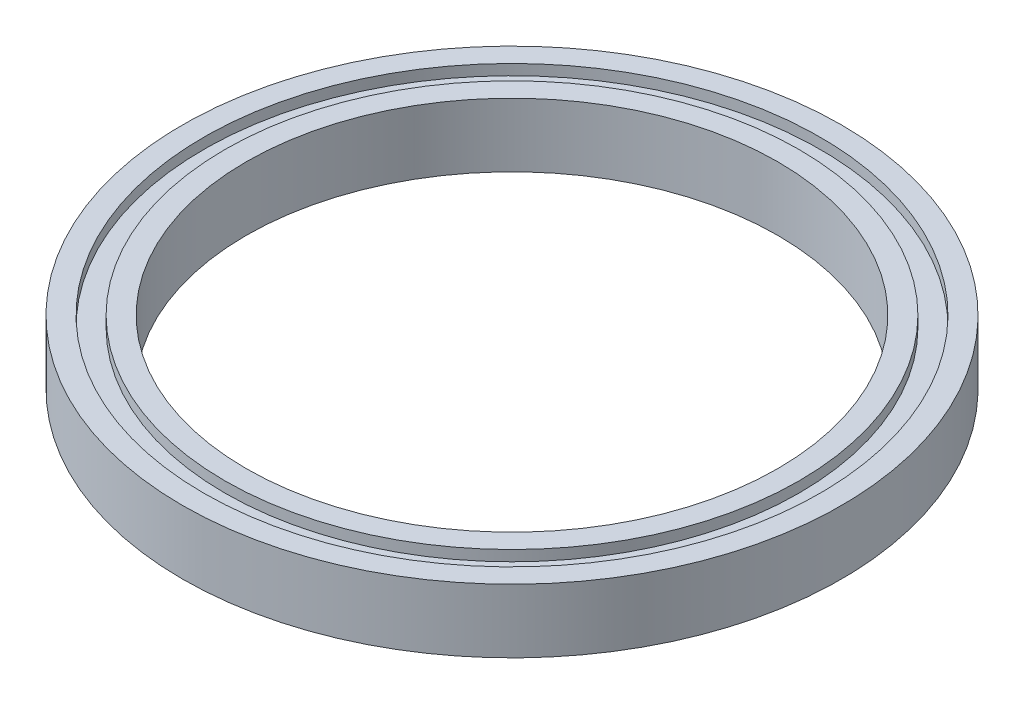
ISO-10303-21;
HEADER;
FILE_DESCRIPTION(('STEP AP214'),'2;1');
FILE_NAME('part.step','',(''),(''),'','','');
FILE_SCHEMA(('AUTOMOTIVE_DESIGN { 1 0 10303 214 1 1 1 1 }'));
ENDSEC;
DATA;
#1=APPLICATION_CONTEXT('core data for automotive mechanical design processes');
#2=APPLICATION_PROTOCOL_DEFINITION('international standard','automotive_design',2000,#1);
#3=PRODUCT_CONTEXT('',#1,'mechanical');
#4=PRODUCT('Part','Part','',(#3));
#5=PRODUCT_RELATED_PRODUCT_CATEGORY('part','',(#4));
#6=PRODUCT_DEFINITION_FORMATION('','',#4);
#7=PRODUCT_DEFINITION_CONTEXT('part definition',#1,'design');
#8=PRODUCT_DEFINITION('design','',#6,#7);
#9=PRODUCT_DEFINITION_SHAPE('','',#8);
#10=(LENGTH_UNIT() NAMED_UNIT(*) SI_UNIT(.MILLI.,.METRE.));
#11=(NAMED_UNIT(*) PLANE_ANGLE_UNIT() SI_UNIT($,.RADIAN.));
#12=(NAMED_UNIT(*) SI_UNIT($,.STERADIAN.) SOLID_ANGLE_UNIT());
#13=UNCERTAINTY_MEASURE_WITH_UNIT(LENGTH_MEASURE(1.E-05),#10,'distance_accuracy_value','');
#14=(GEOMETRIC_REPRESENTATION_CONTEXT(3) GLOBAL_UNCERTAINTY_ASSIGNED_CONTEXT((#13)) GLOBAL_UNIT_ASSIGNED_CONTEXT((#10,
#11,#12)) REPRESENTATION_CONTEXT('',''));
#15=CARTESIAN_POINT('',(0.,0.,0.));
#16=DIRECTION('',(0.,0.,1.));
#17=DIRECTION('',(1.,0.,0.));
#18=AXIS2_PLACEMENT_3D('',#15,#16,#17);
#19=CARTESIAN_POINT('',(0.,0.,0.));
#20=DIRECTION('',(0.,1.,0.));
#21=DIRECTION('',(0.,0.,1.));
#22=AXIS2_PLACEMENT_3D('',#19,#20,#21);
#23=PLANE('',#22);
#24=CARTESIAN_POINT('',(0.,0.,0.));
#25=DIRECTION('',(0.,1.,0.));
#26=DIRECTION('',(0.,0.,1.));
#27=AXIS2_PLACEMENT_3D('',#24,#25,#26);
#28=CIRCLE('',#27,25.);
#29=CARTESIAN_POINT('',(0.,0.,25.));
#30=VERTEX_POINT('',#29);
#31=EDGE_CURVE('E50',#30,#30,#28,.T.);
#32=ORIENTED_EDGE('',*,*,#31,.T.);
#33=EDGE_LOOP('',(#32));
#34=FACE_BOUND('',#33,.T.);
#35=CARTESIAN_POINT('',(0.,0.,0.));
#36=DIRECTION('',(0.,-1.,0.));
#37=DIRECTION('',(0.,0.,-1.));
#38=AXIS2_PLACEMENT_3D('',#35,#36,#37);
#39=CIRCLE('',#38,27.);
#40=CARTESIAN_POINT('',(0.,0.,-27.));
#41=VERTEX_POINT('',#40);
#42=EDGE_CURVE('E74',#41,#41,#39,.T.);
#43=ORIENTED_EDGE('',*,*,#42,.T.);
#44=EDGE_LOOP('',(#43));
#45=FACE_BOUND('',#44,.T.);
#46=ADVANCED_FACE('F37',(#34,#45),#23,.F.);
#47=CARTESIAN_POINT('',(0.,6.,0.));
#48=DIRECTION('',(0.,1.,0.));
#49=DIRECTION('',(0.,0.,1.));
#50=AXIS2_PLACEMENT_3D('',#47,#48,#49);
#51=PLANE('',#50);
#52=CARTESIAN_POINT('',(0.,6.,0.));
#53=DIRECTION('',(0.,1.,0.));
#54=DIRECTION('',(0.,0.,1.));
#55=AXIS2_PLACEMENT_3D('',#52,#53,#54);
#56=CIRCLE('',#55,25.);
#57=CARTESIAN_POINT('',(0.,6.,25.));
#58=VERTEX_POINT('',#57);
#59=EDGE_CURVE('E48',#58,#58,#56,.T.);
#60=ORIENTED_EDGE('',*,*,#59,.F.);
#61=EDGE_LOOP('',(#60));
#62=FACE_BOUND('',#61,.T.);
#63=CARTESIAN_POINT('',(0.,6.,0.));
#64=DIRECTION('',(0.,1.,0.));
#65=DIRECTION('',(0.,0.,1.));
#66=AXIS2_PLACEMENT_3D('',#63,#64,#65);
#67=CIRCLE('',#66,27.);
#68=CARTESIAN_POINT('',(0.,6.,27.));
#69=VERTEX_POINT('',#68);
#70=EDGE_CURVE('E62',#69,#69,#67,.T.);
#71=ORIENTED_EDGE('',*,*,#70,.T.);
#72=EDGE_LOOP('',(#71));
#73=FACE_BOUND('',#72,.T.);
#74=ADVANCED_FACE('F112',(#62,#73),#51,.T.);
#75=CARTESIAN_POINT('',(0.,6.,0.));
#76=DIRECTION('',(0.,1.,0.));
#77=DIRECTION('',(0.,0.,1.));
#78=AXIS2_PLACEMENT_3D('',#75,#76,#77);
#79=CIRCLE('',#78,29.);
#80=CARTESIAN_POINT('',(0.,6.,29.));
#81=VERTEX_POINT('',#80);
#82=EDGE_CURVE('E56',#81,#81,#79,.T.);
#83=ORIENTED_EDGE('',*,*,#82,.F.);
#84=EDGE_LOOP('',(#83));
#85=FACE_BOUND('',#84,.T.);
#86=CARTESIAN_POINT('',(0.,6.,0.));
#87=DIRECTION('',(0.,1.,0.));
#88=DIRECTION('',(0.,0.,1.));
#89=AXIS2_PLACEMENT_3D('',#86,#87,#88);
#90=CIRCLE('',#89,31.);
#91=CARTESIAN_POINT('',(0.,6.,31.));
#92=VERTEX_POINT('',#91);
#93=EDGE_CURVE('E10',#92,#92,#90,.T.);
#94=ORIENTED_EDGE('',*,*,#93,.T.);
#95=EDGE_LOOP('',(#94));
#96=FACE_BOUND('',#95,.T.);
#97=ADVANCED_FACE('F99',(#85,#96),#51,.T.);
#98=CARTESIAN_POINT('',(0.,0.,0.));
#99=DIRECTION('',(0.,-1.,0.));
#100=DIRECTION('',(0.,0.,-1.));
#101=AXIS2_PLACEMENT_3D('',#98,#99,#100);
#102=CIRCLE('',#101,29.);
#103=CARTESIAN_POINT('',(0.,0.,-29.));
#104=VERTEX_POINT('',#103);
#105=EDGE_CURVE('E68',#104,#104,#102,.T.);
#106=ORIENTED_EDGE('',*,*,#105,.F.);
#107=EDGE_LOOP('',(#106));
#108=FACE_BOUND('',#107,.T.);
#109=CARTESIAN_POINT('',(0.,0.,0.));
#110=DIRECTION('',(0.,1.,0.));
#111=DIRECTION('',(0.,0.,1.));
#112=AXIS2_PLACEMENT_3D('',#109,#110,#111);
#113=CIRCLE('',#112,31.);
#114=CARTESIAN_POINT('',(0.,0.,31.));
#115=VERTEX_POINT('',#114);
#116=EDGE_CURVE('E41',#115,#115,#113,.T.);
#117=ORIENTED_EDGE('',*,*,#116,.F.);
#118=EDGE_LOOP('',(#117));
#119=FACE_BOUND('',#118,.T.);
#120=ADVANCED_FACE('F96',(#108,#119),#23,.F.);
#121=CARTESIAN_POINT('',(0.,6.,0.));
#122=DIRECTION('',(0.,-1.,0.));
#123=DIRECTION('',(0.,0.,-1.));
#124=AXIS2_PLACEMENT_3D('',#121,#122,#123);
#125=CYLINDRICAL_SURFACE('',#124,31.);
#126=ORIENTED_EDGE('',*,*,#93,.F.);
#127=EDGE_LOOP('',(#126));
#128=FACE_BOUND('',#127,.T.);
#129=ORIENTED_EDGE('',*,*,#116,.T.);
#130=EDGE_LOOP('',(#129));
#131=FACE_BOUND('',#130,.T.);
#132=ADVANCED_FACE('F39',(#128,#131),#125,.T.);
#133=CARTESIAN_POINT('',(0.,6.,0.));
#134=DIRECTION('',(0.,-1.,0.));
#135=DIRECTION('',(0.,0.,-1.));
#136=AXIS2_PLACEMENT_3D('',#133,#134,#135);
#137=CYLINDRICAL_SURFACE('',#136,25.);
#138=ORIENTED_EDGE('',*,*,#59,.T.);
#139=EDGE_LOOP('',(#138));
#140=FACE_BOUND('',#139,.T.);
#141=ORIENTED_EDGE('',*,*,#31,.F.);
#142=EDGE_LOOP('',(#141));
#143=FACE_BOUND('',#142,.T.);
#144=ADVANCED_FACE('F103',(#140,#143),#137,.F.);
#145=CARTESIAN_POINT('',(0.,5.,0.));
#146=DIRECTION('',(0.,1.,0.));
#147=DIRECTION('',(0.,0.,1.));
#148=AXIS2_PLACEMENT_3D('',#145,#146,#147);
#149=CYLINDRICAL_SURFACE('',#148,29.);
#150=CARTESIAN_POINT('',(0.,5.,0.));
#151=DIRECTION('',(0.,1.,0.));
#152=DIRECTION('',(0.,0.,1.));
#153=AXIS2_PLACEMENT_3D('',#150,#151,#152);
#154=CIRCLE('',#153,29.);
#155=CARTESIAN_POINT('',(0.,5.,29.));
#156=VERTEX_POINT('',#155);
#157=EDGE_CURVE('E53',#156,#156,#154,.T.);
#158=ORIENTED_EDGE('',*,*,#157,.F.);
#159=EDGE_LOOP('',(#158));
#160=FACE_BOUND('',#159,.T.);
#161=ORIENTED_EDGE('',*,*,#82,.T.);
#162=EDGE_LOOP('',(#161));
#163=FACE_BOUND('',#162,.T.);
#164=ADVANCED_FACE('F108',(#160,#163),#149,.F.);
#165=CARTESIAN_POINT('',(0.,5.,0.));
#166=DIRECTION('',(0.,1.,0.));
#167=DIRECTION('',(0.,0.,1.));
#168=AXIS2_PLACEMENT_3D('',#165,#166,#167);
#169=PLANE('',#168);
#170=CARTESIAN_POINT('',(0.,5.,0.));
#171=DIRECTION('',(0.,1.,0.));
#172=DIRECTION('',(0.,0.,1.));
#173=AXIS2_PLACEMENT_3D('',#170,#171,#172);
#174=CIRCLE('',#173,27.);
#175=CARTESIAN_POINT('',(0.,5.,27.));
#176=VERTEX_POINT('',#175);
#177=EDGE_CURVE('E59',#176,#176,#174,.T.);
#178=ORIENTED_EDGE('',*,*,#177,.F.);
#179=EDGE_LOOP('',(#178));
#180=FACE_BOUND('',#179,.T.);
#181=ORIENTED_EDGE('',*,*,#157,.T.);
#182=EDGE_LOOP('',(#181));
#183=FACE_BOUND('',#182,.T.);
#184=ADVANCED_FACE('F125',(#180,#183),#169,.T.);
#185=CARTESIAN_POINT('',(0.,5.,0.));
#186=DIRECTION('',(0.,1.,0.));
#187=DIRECTION('',(0.,0.,1.));
#188=AXIS2_PLACEMENT_3D('',#185,#186,#187);
#189=CYLINDRICAL_SURFACE('',#188,27.);
#190=ORIENTED_EDGE('',*,*,#177,.T.);
#191=EDGE_LOOP('',(#190));
#192=FACE_BOUND('',#191,.T.);
#193=ORIENTED_EDGE('',*,*,#70,.F.);
#194=EDGE_LOOP('',(#193));
#195=FACE_BOUND('',#194,.T.);
#196=ADVANCED_FACE('F92',(#192,#195),#189,.T.);
#197=CARTESIAN_POINT('',(0.,1.,0.));
#198=DIRECTION('',(0.,-1.,0.));
#199=DIRECTION('',(0.,0.,-1.));
#200=AXIS2_PLACEMENT_3D('',#197,#198,#199);
#201=CYLINDRICAL_SURFACE('',#200,29.);
#202=CARTESIAN_POINT('',(0.,1.,0.));
#203=DIRECTION('',(0.,-1.,0.));
#204=DIRECTION('',(0.,0.,-1.));
#205=AXIS2_PLACEMENT_3D('',#202,#203,#204);
#206=CIRCLE('',#205,29.);
#207=CARTESIAN_POINT('',(0.,1.,-29.));
#208=VERTEX_POINT('',#207);
#209=EDGE_CURVE('E65',#208,#208,#206,.T.);
#210=ORIENTED_EDGE('',*,*,#209,.F.);
#211=EDGE_LOOP('',(#210));
#212=FACE_BOUND('',#211,.T.);
#213=ORIENTED_EDGE('',*,*,#105,.T.);
#214=EDGE_LOOP('',(#213));
#215=FACE_BOUND('',#214,.T.);
#216=ADVANCED_FACE('F86',(#212,#215),#201,.F.);
#217=CARTESIAN_POINT('',(0.,1.,0.));
#218=DIRECTION('',(0.,-1.,0.));
#219=DIRECTION('',(0.,0.,-1.));
#220=AXIS2_PLACEMENT_3D('',#217,#218,#219);
#221=PLANE('',#220);
#222=CARTESIAN_POINT('',(0.,1.,0.));
#223=DIRECTION('',(0.,-1.,0.));
#224=DIRECTION('',(0.,0.,-1.));
#225=AXIS2_PLACEMENT_3D('',#222,#223,#224);
#226=CIRCLE('',#225,27.);
#227=CARTESIAN_POINT('',(0.,1.,-27.));
#228=VERTEX_POINT('',#227);
#229=EDGE_CURVE('E71',#228,#228,#226,.T.);
#230=ORIENTED_EDGE('',*,*,#229,.F.);
#231=EDGE_LOOP('',(#230));
#232=FACE_BOUND('',#231,.T.);
#233=ORIENTED_EDGE('',*,*,#209,.T.);
#234=EDGE_LOOP('',(#233));
#235=FACE_BOUND('',#234,.T.);
#236=ADVANCED_FACE('F83',(#232,#235),#221,.T.);
#237=CARTESIAN_POINT('',(0.,1.,0.));
#238=DIRECTION('',(0.,-1.,0.));
#239=DIRECTION('',(0.,0.,-1.));
#240=AXIS2_PLACEMENT_3D('',#237,#238,#239);
#241=CYLINDRICAL_SURFACE('',#240,27.);
#242=ORIENTED_EDGE('',*,*,#229,.T.);
#243=EDGE_LOOP('',(#242));
#244=FACE_BOUND('',#243,.T.);
#245=ORIENTED_EDGE('',*,*,#42,.F.);
#246=EDGE_LOOP('',(#245));
#247=FACE_BOUND('',#246,.T.);
#248=ADVANCED_FACE('F80',(#244,#247),#241,.T.);
#249=CLOSED_SHELL('',(#46,#74,#97,#120,#132,#144,#164,#184,#196,#216,#236,#248));
#250=MANIFOLD_SOLID_BREP('B2',#249);
#251=ADVANCED_BREP_SHAPE_REPRESENTATION('',(#18,#250),#14);
#252=SHAPE_DEFINITION_REPRESENTATION(#9,#251);
ENDSEC;
END-ISO-10303-21;
